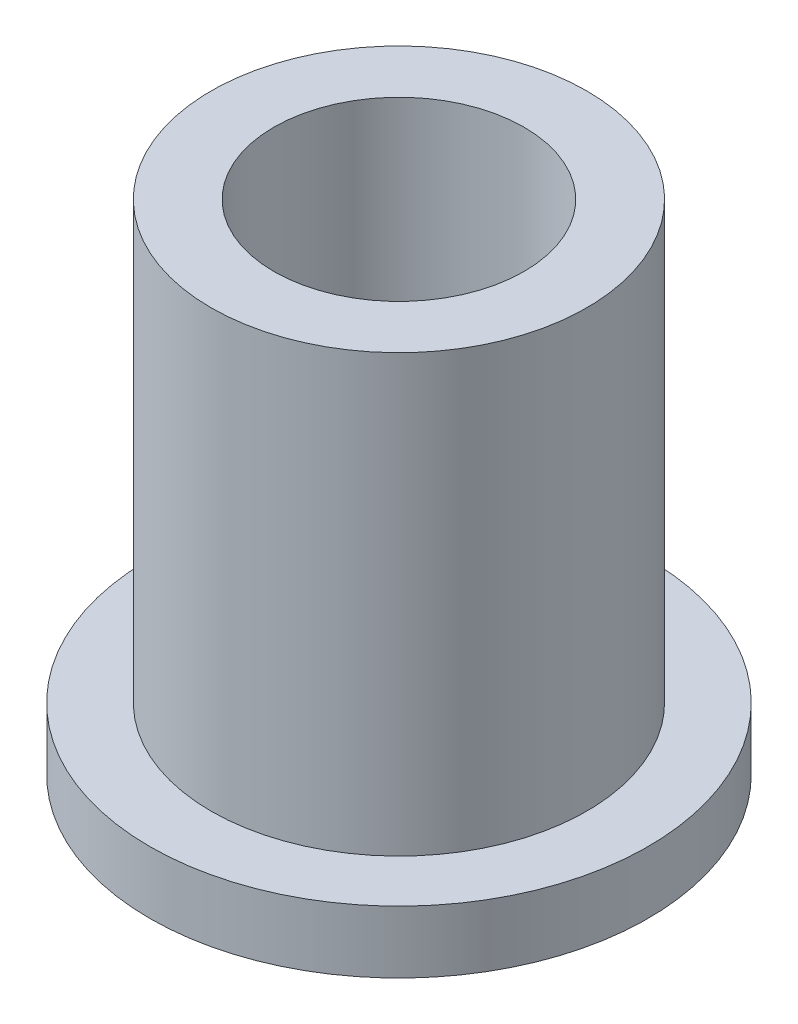
ISO-10303-21;
HEADER;
FILE_DESCRIPTION(('STEP AP214'),'2;1');
FILE_NAME('part.step','',(''),(''),'','','');
FILE_SCHEMA(('AUTOMOTIVE_DESIGN { 1 0 10303 214 1 1 1 1 }'));
ENDSEC;
DATA;
#1=APPLICATION_CONTEXT('core data for automotive mechanical design processes');
#2=APPLICATION_PROTOCOL_DEFINITION('international standard','automotive_design',2000,#1);
#3=PRODUCT_CONTEXT('',#1,'mechanical');
#4=PRODUCT('Part','Part','',(#3));
#5=PRODUCT_RELATED_PRODUCT_CATEGORY('part','',(#4));
#6=PRODUCT_DEFINITION_FORMATION('','',#4);
#7=PRODUCT_DEFINITION_CONTEXT('part definition',#1,'design');
#8=PRODUCT_DEFINITION('design','',#6,#7);
#9=PRODUCT_DEFINITION_SHAPE('','',#8);
#10=(LENGTH_UNIT() NAMED_UNIT(*) SI_UNIT(.MILLI.,.METRE.));
#11=(NAMED_UNIT(*) PLANE_ANGLE_UNIT() SI_UNIT($,.RADIAN.));
#12=(NAMED_UNIT(*) SI_UNIT($,.STERADIAN.) SOLID_ANGLE_UNIT());
#13=UNCERTAINTY_MEASURE_WITH_UNIT(LENGTH_MEASURE(1.E-05),#10,'distance_accuracy_value','');
#14=(GEOMETRIC_REPRESENTATION_CONTEXT(3) GLOBAL_UNCERTAINTY_ASSIGNED_CONTEXT((#13)) GLOBAL_UNIT_ASSIGNED_CONTEXT((#10,
#11,#12)) REPRESENTATION_CONTEXT('',''));
#15=CARTESIAN_POINT('',(0.,0.,0.));
#16=DIRECTION('',(0.,0.,1.));
#17=DIRECTION('',(1.,0.,0.));
#18=AXIS2_PLACEMENT_3D('',#15,#16,#17);
#19=CARTESIAN_POINT('',(0.,12.7,0.));
#20=DIRECTION('',(0.,1.,0.));
#21=DIRECTION('',(0.,0.,1.));
#22=AXIS2_PLACEMENT_3D('',#19,#20,#21);
#23=PLANE('',#22);
#24=CARTESIAN_POINT('',(0.,12.7,0.));
#25=DIRECTION('',(0.,1.,0.));
#26=DIRECTION('',(0.,0.,1.));
#27=AXIS2_PLACEMENT_3D('',#24,#25,#26);
#28=CIRCLE('',#27,4.7879);
#29=CARTESIAN_POINT('',(0.,12.7,4.7879));
#30=VERTEX_POINT('',#29);
#31=EDGE_CURVE('E10',#30,#30,#28,.T.);
#32=ORIENTED_EDGE('',*,*,#31,.T.);
#33=EDGE_LOOP('',(#32));
#34=FACE_BOUND('',#33,.T.);
#35=CARTESIAN_POINT('',(0.,12.7,0.));
#36=DIRECTION('',(0.,1.,0.));
#37=DIRECTION('',(0.,0.,1.));
#38=AXIS2_PLACEMENT_3D('',#35,#36,#37);
#39=CIRCLE('',#38,3.1877);
#40=CARTESIAN_POINT('',(0.,12.7,3.1877));
#41=VERTEX_POINT('',#40);
#42=EDGE_CURVE('E37',#41,#41,#39,.T.);
#43=ORIENTED_EDGE('',*,*,#42,.F.);
#44=EDGE_LOOP('',(#43));
#45=FACE_BOUND('',#44,.T.);
#46=ADVANCED_FACE('F30',(#34,#45),#23,.T.);
#47=CARTESIAN_POINT('',(0.,0.,0.));
#48=DIRECTION('',(0.,1.,0.));
#49=DIRECTION('',(0.,0.,1.));
#50=AXIS2_PLACEMENT_3D('',#47,#48,#49);
#51=PLANE('',#50);
#52=CARTESIAN_POINT('',(0.,0.,0.));
#53=DIRECTION('',(0.,1.,0.));
#54=DIRECTION('',(0.,0.,1.));
#55=AXIS2_PLACEMENT_3D('',#52,#53,#54);
#56=CIRCLE('',#55,3.1877);
#57=CARTESIAN_POINT('',(0.,0.,3.1877));
#58=VERTEX_POINT('',#57);
#59=EDGE_CURVE('E41',#58,#58,#56,.T.);
#60=ORIENTED_EDGE('',*,*,#59,.T.);
#61=EDGE_LOOP('',(#60));
#62=FACE_BOUND('',#61,.T.);
#63=CARTESIAN_POINT('',(0.,0.,0.));
#64=DIRECTION('',(0.,1.,0.));
#65=DIRECTION('',(0.,0.,1.));
#66=AXIS2_PLACEMENT_3D('',#63,#64,#65);
#67=CIRCLE('',#66,6.35);
#68=CARTESIAN_POINT('',(0.,0.,6.35));
#69=VERTEX_POINT('',#68);
#70=EDGE_CURVE('E48',#69,#69,#67,.T.);
#71=ORIENTED_EDGE('',*,*,#70,.F.);
#72=EDGE_LOOP('',(#71));
#73=FACE_BOUND('',#72,.T.);
#74=ADVANCED_FACE('F73',(#62,#73),#51,.F.);
#75=CARTESIAN_POINT('',(0.,12.7,0.));
#76=DIRECTION('',(0.,-1.,0.));
#77=DIRECTION('',(0.,0.,-1.));
#78=AXIS2_PLACEMENT_3D('',#75,#76,#77);
#79=CYLINDRICAL_SURFACE('',#78,4.7879);
#80=CARTESIAN_POINT('',(0.,1.5875,0.));
#81=DIRECTION('',(0.,1.,0.));
#82=DIRECTION('',(0.,0.,1.));
#83=AXIS2_PLACEMENT_3D('',#80,#81,#82);
#84=CIRCLE('',#83,4.7879);
#85=CARTESIAN_POINT('',(0.,1.5875,4.7879));
#86=VERTEX_POINT('',#85);
#87=EDGE_CURVE('E51',#86,#86,#84,.T.);
#88=ORIENTED_EDGE('',*,*,#87,.T.);
#89=EDGE_LOOP('',(#88));
#90=FACE_BOUND('',#89,.T.);
#91=ORIENTED_EDGE('',*,*,#31,.F.);
#92=EDGE_LOOP('',(#91));
#93=FACE_BOUND('',#92,.T.);
#94=ADVANCED_FACE('F32',(#90,#93),#79,.T.);
#95=CARTESIAN_POINT('',(0.,12.7,0.));
#96=DIRECTION('',(0.,-1.,0.));
#97=DIRECTION('',(0.,0.,-1.));
#98=AXIS2_PLACEMENT_3D('',#95,#96,#97);
#99=CYLINDRICAL_SURFACE('',#98,3.1877);
#100=ORIENTED_EDGE('',*,*,#42,.T.);
#101=EDGE_LOOP('',(#100));
#102=FACE_BOUND('',#101,.T.);
#103=ORIENTED_EDGE('',*,*,#59,.F.);
#104=EDGE_LOOP('',(#103));
#105=FACE_BOUND('',#104,.T.);
#106=ADVANCED_FACE('F62',(#102,#105),#99,.F.);
#107=CARTESIAN_POINT('',(0.,1.5875,0.));
#108=DIRECTION('',(0.,1.,0.));
#109=DIRECTION('',(0.,0.,1.));
#110=AXIS2_PLACEMENT_3D('',#107,#108,#109);
#111=PLANE('',#110);
#112=CARTESIAN_POINT('',(0.,1.5875,0.));
#113=DIRECTION('',(0.,1.,0.));
#114=DIRECTION('',(0.,0.,1.));
#115=AXIS2_PLACEMENT_3D('',#112,#113,#114);
#116=CIRCLE('',#115,6.35);
#117=CARTESIAN_POINT('',(0.,1.5875,6.35));
#118=VERTEX_POINT('',#117);
#119=EDGE_CURVE('E46',#118,#118,#116,.T.);
#120=ORIENTED_EDGE('',*,*,#119,.T.);
#121=EDGE_LOOP('',(#120));
#122=FACE_BOUND('',#121,.T.);
#123=ORIENTED_EDGE('',*,*,#87,.F.);
#124=EDGE_LOOP('',(#123));
#125=FACE_BOUND('',#124,.T.);
#126=ADVANCED_FACE('F59',(#122,#125),#111,.T.);
#127=CARTESIAN_POINT('',(0.,1.5875,0.));
#128=DIRECTION('',(0.,-1.,0.));
#129=DIRECTION('',(0.,0.,-1.));
#130=AXIS2_PLACEMENT_3D('',#127,#128,#129);
#131=CYLINDRICAL_SURFACE('',#130,6.35);
#132=ORIENTED_EDGE('',*,*,#119,.F.);
#133=EDGE_LOOP('',(#132));
#134=FACE_BOUND('',#133,.T.);
#135=ORIENTED_EDGE('',*,*,#70,.T.);
#136=EDGE_LOOP('',(#135));
#137=FACE_BOUND('',#136,.T.);
#138=ADVANCED_FACE('F61',(#134,#137),#131,.T.);
#139=CLOSED_SHELL('',(#46,#74,#94,#106,#126,#138));
#140=MANIFOLD_SOLID_BREP('B2',#139);
#141=ADVANCED_BREP_SHAPE_REPRESENTATION('',(#18,#140),#14);
#142=SHAPE_DEFINITION_REPRESENTATION(#9,#141);
ENDSEC;
END-ISO-10303-21;
